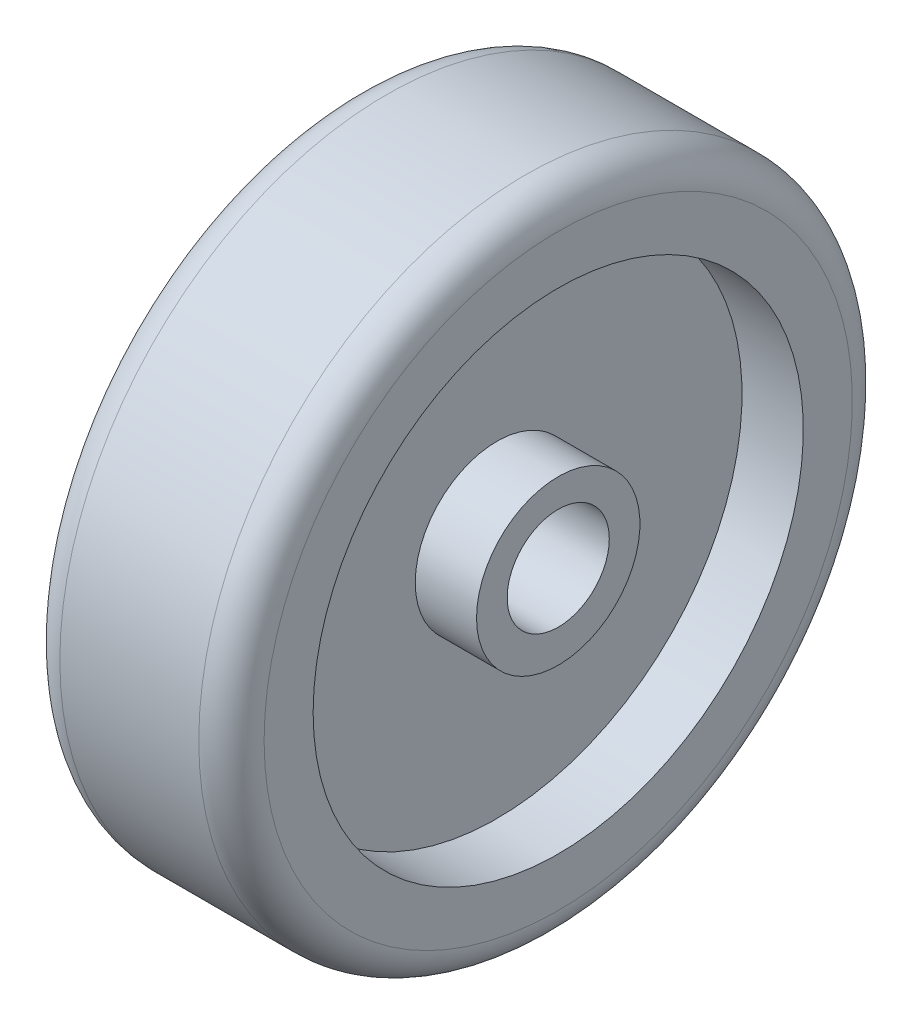
ISO-10303-21;
HEADER;
FILE_DESCRIPTION(('STEP AP214'),'2;1');
FILE_NAME('part.step','',(''),(''),'','','');
FILE_SCHEMA(('AUTOMOTIVE_DESIGN { 1 0 10303 214 1 1 1 1 }'));
ENDSEC;
DATA;
#1=APPLICATION_CONTEXT('core data for automotive mechanical design processes');
#2=APPLICATION_PROTOCOL_DEFINITION('international standard','automotive_design',2000,#1);
#3=PRODUCT_CONTEXT('',#1,'mechanical');
#4=PRODUCT('Part','Part','',(#3));
#5=PRODUCT_RELATED_PRODUCT_CATEGORY('part','',(#4));
#6=PRODUCT_DEFINITION_FORMATION('','',#4);
#7=PRODUCT_DEFINITION_CONTEXT('part definition',#1,'design');
#8=PRODUCT_DEFINITION('design','',#6,#7);
#9=PRODUCT_DEFINITION_SHAPE('','',#8);
#10=(LENGTH_UNIT() NAMED_UNIT(*) SI_UNIT(.MILLI.,.METRE.));
#11=(NAMED_UNIT(*) PLANE_ANGLE_UNIT() SI_UNIT($,.RADIAN.));
#12=(NAMED_UNIT(*) SI_UNIT($,.STERADIAN.) SOLID_ANGLE_UNIT());
#13=UNCERTAINTY_MEASURE_WITH_UNIT(LENGTH_MEASURE(1.E-05),#10,'distance_accuracy_value','');
#14=(GEOMETRIC_REPRESENTATION_CONTEXT(3) GLOBAL_UNCERTAINTY_ASSIGNED_CONTEXT((#13)) GLOBAL_UNIT_ASSIGNED_CONTEXT((#10,
#11,#12)) REPRESENTATION_CONTEXT('',''));
#15=CARTESIAN_POINT('',(0.,0.,0.));
#16=DIRECTION('',(0.,0.,1.));
#17=DIRECTION('',(1.,0.,0.));
#18=AXIS2_PLACEMENT_3D('',#15,#16,#17);
#19=CARTESIAN_POINT('',(31.75,-0.729526652101718,0.));
#20=DIRECTION('',(-1.,0.,0.));
#21=DIRECTION('',(0.,0.,1.));
#22=AXIS2_PLACEMENT_3D('',#19,#20,#21);
#23=PLANE('',#22);
#24=CARTESIAN_POINT('',(31.75,0.,0.));
#25=DIRECTION('',(1.,0.,0.));
#26=DIRECTION('',(0.,0.,-1.));
#27=AXIS2_PLACEMENT_3D('',#24,#25,#26);
#28=CIRCLE('',#27,15.875);
#29=CARTESIAN_POINT('',(31.75,0.,-15.875));
#30=VERTEX_POINT('',#29);
#31=EDGE_CURVE('E112',#30,#30,#28,.T.);
#32=ORIENTED_EDGE('',*,*,#31,.F.);
#33=EDGE_LOOP('',(#32));
#34=FACE_BOUND('',#33,.T.);
#35=CARTESIAN_POINT('',(31.75,-0.729526652101718,0.));
#36=DIRECTION('',(-1.,0.,0.));
#37=DIRECTION('',(0.,0.,1.));
#38=AXIS2_PLACEMENT_3D('',#35,#36,#37);
#39=CIRCLE('',#38,25.4);
#40=CARTESIAN_POINT('',(31.75,-0.729526652101718,25.4));
#41=VERTEX_POINT('',#40);
#42=EDGE_CURVE('E79',#41,#41,#39,.T.);
#43=ORIENTED_EDGE('',*,*,#42,.F.);
#44=EDGE_LOOP('',(#43));
#45=FACE_BOUND('',#44,.T.);
#46=ADVANCED_FACE('F55',(#34,#45),#23,.F.);
#47=CARTESIAN_POINT('',(-31.75,-0.729526652101718,0.));
#48=DIRECTION('',(-1.,0.,0.));
#49=DIRECTION('',(0.,0.,1.));
#50=AXIS2_PLACEMENT_3D('',#47,#48,#49);
#51=CYLINDRICAL_SURFACE('',#50,25.4);
#52=CARTESIAN_POINT('',(12.7,-0.729526652101718,0.));
#53=DIRECTION('',(-1.,0.,0.));
#54=DIRECTION('',(0.,0.,1.));
#55=AXIS2_PLACEMENT_3D('',#52,#53,#54);
#56=CIRCLE('',#55,25.4);
#57=CARTESIAN_POINT('',(12.7,-0.729526652101718,25.4));
#58=VERTEX_POINT('',#57);
#59=EDGE_CURVE('E83',#58,#58,#56,.T.);
#60=ORIENTED_EDGE('',*,*,#59,.F.);
#61=EDGE_LOOP('',(#60));
#62=FACE_BOUND('',#61,.T.);
#63=ORIENTED_EDGE('',*,*,#42,.T.);
#64=EDGE_LOOP('',(#63));
#65=FACE_BOUND('',#64,.T.);
#66=ADVANCED_FACE('F132',(#62,#65),#51,.T.);
#67=CARTESIAN_POINT('',(12.7,24.6704733478983,0.));
#68=DIRECTION('',(-1.,0.,0.));
#69=DIRECTION('',(0.,0.,1.));
#70=AXIS2_PLACEMENT_3D('',#67,#68,#69);
#71=PLANE('',#70);
#72=CARTESIAN_POINT('',(12.7,-0.729526652101718,0.));
#73=DIRECTION('',(-1.,0.,0.));
#74=DIRECTION('',(0.,0.,1.));
#75=AXIS2_PLACEMENT_3D('',#72,#73,#74);
#76=CIRCLE('',#75,76.2);
#77=CARTESIAN_POINT('',(12.7,-0.729526652101718,76.2));
#78=VERTEX_POINT('',#77);
#79=EDGE_CURVE('E87',#78,#78,#76,.T.);
#80=ORIENTED_EDGE('',*,*,#79,.F.);
#81=EDGE_LOOP('',(#80));
#82=FACE_BOUND('',#81,.T.);
#83=ORIENTED_EDGE('',*,*,#59,.T.);
#84=EDGE_LOOP('',(#83));
#85=FACE_BOUND('',#84,.T.);
#86=ADVANCED_FACE('F137',(#82,#85),#71,.F.);
#87=CARTESIAN_POINT('',(-31.75,-0.729526652101718,0.));
#88=DIRECTION('',(-1.,0.,0.));
#89=DIRECTION('',(0.,0.,1.));
#90=AXIS2_PLACEMENT_3D('',#87,#88,#89);
#91=CYLINDRICAL_SURFACE('',#90,76.2);
#92=CARTESIAN_POINT('',(31.75,-0.729526652101718,0.));
#93=DIRECTION('',(-1.,0.,0.));
#94=DIRECTION('',(0.,0.,1.));
#95=AXIS2_PLACEMENT_3D('',#92,#93,#94);
#96=CIRCLE('',#95,76.2);
#97=CARTESIAN_POINT('',(31.75,-0.729526652101718,76.2));
#98=VERTEX_POINT('',#97);
#99=EDGE_CURVE('E91',#98,#98,#96,.T.);
#100=ORIENTED_EDGE('',*,*,#99,.F.);
#101=EDGE_LOOP('',(#100));
#102=FACE_BOUND('',#101,.T.);
#103=ORIENTED_EDGE('',*,*,#79,.T.);
#104=EDGE_LOOP('',(#103));
#105=FACE_BOUND('',#104,.T.);
#106=ADVANCED_FACE('F143',(#102,#105),#91,.F.);
#107=CARTESIAN_POINT('',(31.75,75.4704733478983,0.));
#108=DIRECTION('',(-1.,0.,0.));
#109=DIRECTION('',(0.,0.,1.));
#110=AXIS2_PLACEMENT_3D('',#107,#108,#109);
#111=PLANE('',#110);
#112=CARTESIAN_POINT('',(31.75,-0.729526652101718,0.));
#113=DIRECTION('',(-1.,0.,0.));
#114=DIRECTION('',(0.,0.,1.));
#115=AXIS2_PLACEMENT_3D('',#112,#113,#114);
#116=CIRCLE('',#115,91.44);
#117=CARTESIAN_POINT('',(31.75,-0.729526652101718,91.44));
#118=VERTEX_POINT('',#117);
#119=EDGE_CURVE('E68',#118,#118,#116,.F.);
#120=ORIENTED_EDGE('',*,*,#119,.T.);
#121=EDGE_LOOP('',(#120));
#122=FACE_BOUND('',#121,.T.);
#123=ORIENTED_EDGE('',*,*,#99,.T.);
#124=EDGE_LOOP('',(#123));
#125=FACE_BOUND('',#124,.T.);
#126=ADVANCED_FACE('F161',(#122,#125),#111,.F.);
#127=CARTESIAN_POINT('',(-31.75,-0.729526652101718,0.));
#128=DIRECTION('',(-1.,0.,0.));
#129=DIRECTION('',(0.,0.,1.));
#130=AXIS2_PLACEMENT_3D('',#127,#128,#129);
#131=CYLINDRICAL_SURFACE('',#130,101.6);
#132=CARTESIAN_POINT('',(-21.59,-0.729526652101718,0.));
#133=DIRECTION('',(1.,0.,0.));
#134=DIRECTION('',(0.,0.,-1.));
#135=AXIS2_PLACEMENT_3D('',#132,#133,#134);
#136=CIRCLE('',#135,101.6);
#137=CARTESIAN_POINT('',(-21.59,-0.729526652101718,-101.6));
#138=VERTEX_POINT('',#137);
#139=EDGE_CURVE('E11',#138,#138,#136,.T.);
#140=ORIENTED_EDGE('',*,*,#139,.T.);
#141=EDGE_LOOP('',(#140));
#142=FACE_BOUND('',#141,.T.);
#143=CARTESIAN_POINT('',(21.59,-0.729526652101718,0.));
#144=DIRECTION('',(-1.,0.,0.));
#145=DIRECTION('',(0.,0.,1.));
#146=AXIS2_PLACEMENT_3D('',#143,#144,#145);
#147=CIRCLE('',#146,101.6);
#148=CARTESIAN_POINT('',(21.59,-0.729526652101718,101.6));
#149=VERTEX_POINT('',#148);
#150=EDGE_CURVE('E73',#149,#149,#147,.T.);
#151=ORIENTED_EDGE('',*,*,#150,.T.);
#152=EDGE_LOOP('',(#151));
#153=FACE_BOUND('',#152,.T.);
#154=ADVANCED_FACE('F158',(#142,#153),#131,.T.);
#155=CARTESIAN_POINT('',(-31.75,75.4704733478983,0.));
#156=DIRECTION('',(1.,0.,0.));
#157=DIRECTION('',(0.,0.,-1.));
#158=AXIS2_PLACEMENT_3D('',#155,#156,#157);
#159=PLANE('',#158);
#160=CARTESIAN_POINT('',(-31.75,-0.729526652101718,0.));
#161=DIRECTION('',(1.,0.,0.));
#162=DIRECTION('',(0.,0.,-1.));
#163=AXIS2_PLACEMENT_3D('',#160,#161,#162);
#164=CIRCLE('',#163,91.44);
#165=CARTESIAN_POINT('',(-31.75,-0.729526652101718,-91.44));
#166=VERTEX_POINT('',#165);
#167=EDGE_CURVE('E63',#166,#166,#164,.F.);
#168=ORIENTED_EDGE('',*,*,#167,.T.);
#169=EDGE_LOOP('',(#168));
#170=FACE_BOUND('',#169,.T.);
#171=CARTESIAN_POINT('',(-31.75,-0.729526652101718,0.));
#172=DIRECTION('',(-1.,0.,0.));
#173=DIRECTION('',(0.,0.,1.));
#174=AXIS2_PLACEMENT_3D('',#171,#172,#173);
#175=CIRCLE('',#174,76.2);
#176=CARTESIAN_POINT('',(-31.75,-0.729526652101718,76.2));
#177=VERTEX_POINT('',#176);
#178=EDGE_CURVE('E95',#177,#177,#175,.T.);
#179=ORIENTED_EDGE('',*,*,#178,.F.);
#180=EDGE_LOOP('',(#179));
#181=FACE_BOUND('',#180,.T.);
#182=ADVANCED_FACE('F160',(#170,#181),#159,.F.);
#183=CARTESIAN_POINT('',(-31.75,-0.729526652101718,0.));
#184=DIRECTION('',(-1.,0.,0.));
#185=DIRECTION('',(0.,0.,1.));
#186=AXIS2_PLACEMENT_3D('',#183,#184,#185);
#187=CYLINDRICAL_SURFACE('',#186,76.2);
#188=CARTESIAN_POINT('',(-12.7,-0.729526652101718,0.));
#189=DIRECTION('',(-1.,0.,0.));
#190=DIRECTION('',(0.,0.,1.));
#191=AXIS2_PLACEMENT_3D('',#188,#189,#190);
#192=CIRCLE('',#191,76.2);
#193=CARTESIAN_POINT('',(-12.7,-0.729526652101718,76.2));
#194=VERTEX_POINT('',#193);
#195=EDGE_CURVE('E99',#194,#194,#192,.T.);
#196=ORIENTED_EDGE('',*,*,#195,.F.);
#197=EDGE_LOOP('',(#196));
#198=FACE_BOUND('',#197,.T.);
#199=ORIENTED_EDGE('',*,*,#178,.T.);
#200=EDGE_LOOP('',(#199));
#201=FACE_BOUND('',#200,.T.);
#202=ADVANCED_FACE('F167',(#198,#201),#187,.F.);
#203=CARTESIAN_POINT('',(-12.7,24.6704733478983,0.));
#204=DIRECTION('',(1.,0.,0.));
#205=DIRECTION('',(0.,0.,-1.));
#206=AXIS2_PLACEMENT_3D('',#203,#204,#205);
#207=PLANE('',#206);
#208=CARTESIAN_POINT('',(-12.7,-0.729526652101718,0.));
#209=DIRECTION('',(-1.,0.,0.));
#210=DIRECTION('',(0.,0.,1.));
#211=AXIS2_PLACEMENT_3D('',#208,#209,#210);
#212=CIRCLE('',#211,25.4);
#213=CARTESIAN_POINT('',(-12.7,-0.729526652101718,25.4));
#214=VERTEX_POINT('',#213);
#215=EDGE_CURVE('E103',#214,#214,#212,.T.);
#216=ORIENTED_EDGE('',*,*,#215,.F.);
#217=EDGE_LOOP('',(#216));
#218=FACE_BOUND('',#217,.T.);
#219=ORIENTED_EDGE('',*,*,#195,.T.);
#220=EDGE_LOOP('',(#219));
#221=FACE_BOUND('',#220,.T.);
#222=ADVANCED_FACE('F220',(#218,#221),#207,.F.);
#223=CARTESIAN_POINT('',(-31.75,-0.729526652101718,0.));
#224=DIRECTION('',(-1.,0.,0.));
#225=DIRECTION('',(0.,0.,1.));
#226=AXIS2_PLACEMENT_3D('',#223,#224,#225);
#227=CYLINDRICAL_SURFACE('',#226,25.4);
#228=CARTESIAN_POINT('',(-31.75,-0.729526652101718,0.));
#229=DIRECTION('',(-1.,0.,0.));
#230=DIRECTION('',(0.,0.,1.));
#231=AXIS2_PLACEMENT_3D('',#228,#229,#230);
#232=CIRCLE('',#231,25.4);
#233=CARTESIAN_POINT('',(-31.75,-0.729526652101718,25.4));
#234=VERTEX_POINT('',#233);
#235=EDGE_CURVE('E107',#234,#234,#232,.T.);
#236=ORIENTED_EDGE('',*,*,#235,.F.);
#237=EDGE_LOOP('',(#236));
#238=FACE_BOUND('',#237,.T.);
#239=ORIENTED_EDGE('',*,*,#215,.T.);
#240=EDGE_LOOP('',(#239));
#241=FACE_BOUND('',#240,.T.);
#242=ADVANCED_FACE('F226',(#238,#241),#227,.T.);
#243=CARTESIAN_POINT('',(-31.75,-0.729526652101718,0.));
#244=DIRECTION('',(1.,0.,0.));
#245=DIRECTION('',(0.,0.,-1.));
#246=AXIS2_PLACEMENT_3D('',#243,#244,#245);
#247=PLANE('',#246);
#248=CARTESIAN_POINT('',(-31.75,0.,0.));
#249=DIRECTION('',(1.,0.,0.));
#250=DIRECTION('',(0.,0.,-1.));
#251=AXIS2_PLACEMENT_3D('',#248,#249,#250);
#252=CIRCLE('',#251,15.875);
#253=CARTESIAN_POINT('',(-31.75,0.,-15.875));
#254=VERTEX_POINT('',#253);
#255=EDGE_CURVE('E111',#254,#254,#252,.T.);
#256=ORIENTED_EDGE('',*,*,#255,.T.);
#257=EDGE_LOOP('',(#256));
#258=FACE_BOUND('',#257,.T.);
#259=ORIENTED_EDGE('',*,*,#235,.T.);
#260=EDGE_LOOP('',(#259));
#261=FACE_BOUND('',#260,.T.);
#262=ADVANCED_FACE('F120',(#258,#261),#247,.F.);
#263=CARTESIAN_POINT('',(-31.75,0.,0.));
#264=DIRECTION('',(1.,0.,0.));
#265=DIRECTION('',(0.,0.,-1.));
#266=AXIS2_PLACEMENT_3D('',#263,#264,#265);
#267=CYLINDRICAL_SURFACE('',#266,15.875);
#268=ORIENTED_EDGE('',*,*,#255,.F.);
#269=EDGE_LOOP('',(#268));
#270=FACE_BOUND('',#269,.T.);
#271=ORIENTED_EDGE('',*,*,#31,.T.);
#272=EDGE_LOOP('',(#271));
#273=FACE_BOUND('',#272,.T.);
#274=ADVANCED_FACE('F123',(#270,#273),#267,.F.);
#275=CARTESIAN_POINT('',(21.59,-0.729526652101718,0.));
#276=DIRECTION('',(-1.,0.,0.));
#277=DIRECTION('',(0.,0.,1.));
#278=AXIS2_PLACEMENT_3D('',#275,#276,#277);
#279=TOROIDAL_SURFACE('',#278,91.44,10.16);
#280=ORIENTED_EDGE('',*,*,#119,.F.);
#281=EDGE_LOOP('',(#280));
#282=FACE_BOUND('',#281,.T.);
#283=ORIENTED_EDGE('',*,*,#150,.F.);
#284=EDGE_LOOP('',(#283));
#285=FACE_BOUND('',#284,.T.);
#286=ADVANCED_FACE('F126',(#282,#285),#279,.T.);
#287=CARTESIAN_POINT('',(-21.59,-0.729526652101718,0.));
#288=DIRECTION('',(1.,0.,0.));
#289=DIRECTION('',(0.,0.,-1.));
#290=AXIS2_PLACEMENT_3D('',#287,#288,#289);
#291=TOROIDAL_SURFACE('',#290,91.44,10.16);
#292=ORIENTED_EDGE('',*,*,#139,.F.);
#293=EDGE_LOOP('',(#292));
#294=FACE_BOUND('',#293,.T.);
#295=ORIENTED_EDGE('',*,*,#167,.F.);
#296=EDGE_LOOP('',(#295));
#297=FACE_BOUND('',#296,.T.);
#298=ADVANCED_FACE('F57',(#294,#297),#291,.T.);
#299=CLOSED_SHELL('',(#46,#66,#86,#106,#126,#154,#182,#202,#222,#242,#262,#274,#286,#298));
#300=MANIFOLD_SOLID_BREP('B2',#299);
#301=ADVANCED_BREP_SHAPE_REPRESENTATION('',(#18,#300),#14);
#302=SHAPE_DEFINITION_REPRESENTATION(#9,#301);
ENDSEC;
END-ISO-10303-21;
